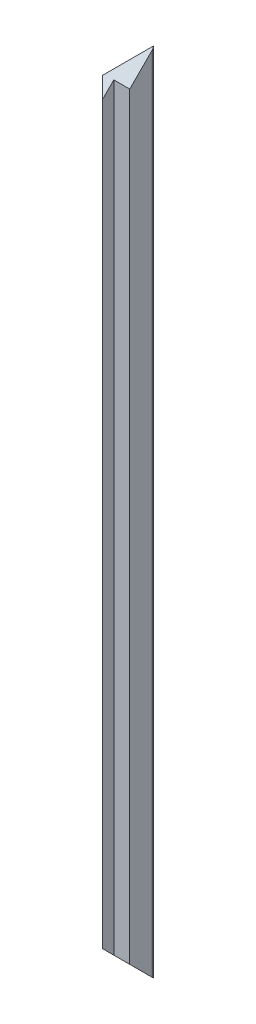
ISO-10303-21;
HEADER;
FILE_DESCRIPTION(('STEP AP214'),'2;1');
FILE_NAME('part.step','',(''),(''),'','','');
FILE_SCHEMA(('AUTOMOTIVE_DESIGN { 1 0 10303 214 1 1 1 1 }'));
ENDSEC;
DATA;
#1=APPLICATION_CONTEXT('core data for automotive mechanical design processes');
#2=APPLICATION_PROTOCOL_DEFINITION('international standard','automotive_design',2000,#1);
#3=PRODUCT_CONTEXT('',#1,'mechanical');
#4=PRODUCT('Part','Part','',(#3));
#5=PRODUCT_RELATED_PRODUCT_CATEGORY('part','',(#4));
#6=PRODUCT_DEFINITION_FORMATION('','',#4);
#7=PRODUCT_DEFINITION_CONTEXT('part definition',#1,'design');
#8=PRODUCT_DEFINITION('design','',#6,#7);
#9=PRODUCT_DEFINITION_SHAPE('','',#8);
#10=(LENGTH_UNIT() NAMED_UNIT(*) SI_UNIT(.MILLI.,.METRE.));
#11=(NAMED_UNIT(*) PLANE_ANGLE_UNIT() SI_UNIT($,.RADIAN.));
#12=(NAMED_UNIT(*) SI_UNIT($,.STERADIAN.) SOLID_ANGLE_UNIT());
#13=UNCERTAINTY_MEASURE_WITH_UNIT(LENGTH_MEASURE(1.E-05),#10,'distance_accuracy_value','');
#14=(GEOMETRIC_REPRESENTATION_CONTEXT(3) GLOBAL_UNCERTAINTY_ASSIGNED_CONTEXT((#13)) GLOBAL_UNIT_ASSIGNED_CONTEXT((#10,
#11,#12)) REPRESENTATION_CONTEXT('',''));
#15=CARTESIAN_POINT('',(0.,0.,0.));
#16=DIRECTION('',(0.,0.,1.));
#17=DIRECTION('',(1.,0.,0.));
#18=AXIS2_PLACEMENT_3D('',#15,#16,#17);
#19=CARTESIAN_POINT('',(118.75,127.,-118.75));
#20=DIRECTION('',(0.707106781186548,0.,-0.707106781186548));
#21=DIRECTION('',(-0.707106781186548,0.,-0.707106781186548));
#22=AXIS2_PLACEMENT_3D('',#19,#20,#21);
#23=PLANE('',#22);
#24=DIRECTION('',(0.577350269189626,-0.577350269189625,0.577350269189626));
#25=VECTOR('',#24,1.);
#26=CARTESIAN_POINT('',(116.,121.5,-121.5));
#27=LINE('',#26,#25);
#28=CARTESIAN_POINT('',(118.75,118.75,-118.75));
#29=VERTEX_POINT('',#28);
#30=CARTESIAN_POINT('',(122.,115.5,-115.5));
#31=VERTEX_POINT('',#30);
#32=EDGE_CURVE('E195',#29,#31,#27,.T.);
#33=ORIENTED_EDGE('',*,*,#32,.F.);
#34=DIRECTION('',(-0.577350269189626,-0.577350269189625,-0.577350269189626));
#35=VECTOR('',#34,1.);
#36=CARTESIAN_POINT('',(121.5,121.5,-116.));
#37=LINE('',#36,#35);
#38=CARTESIAN_POINT('',(115.5,115.5,-122.));
#39=VERTEX_POINT('',#38);
#40=EDGE_CURVE('E173',#29,#39,#37,.T.);
#41=ORIENTED_EDGE('',*,*,#40,.T.);
#42=DIRECTION('',(0.,-1.,0.));
#43=VECTOR('',#42,1.);
#44=CARTESIAN_POINT('',(115.5,127.,-122.));
#45=LINE('',#44,#43);
#46=CARTESIAN_POINT('',(115.5,-115.5,-122.));
#47=VERTEX_POINT('',#46);
#48=EDGE_CURVE('E137',#39,#47,#45,.T.);
#49=ORIENTED_EDGE('',*,*,#48,.T.);
#50=DIRECTION('',(-0.577350269189626,0.577350269189625,-0.577350269189626));
#51=VECTOR('',#50,1.);
#52=CARTESIAN_POINT('',(121.5,-121.5,-116.));
#53=LINE('',#52,#51);
#54=CARTESIAN_POINT('',(118.75,-118.75,-118.75));
#55=VERTEX_POINT('',#54);
#56=EDGE_CURVE('E122',#55,#47,#53,.T.);
#57=ORIENTED_EDGE('',*,*,#56,.F.);
#58=DIRECTION('',(0.577350269189626,0.577350269189625,0.577350269189626));
#59=VECTOR('',#58,1.);
#60=CARTESIAN_POINT('',(116.,-121.5,-121.5));
#61=LINE('',#60,#59);
#62=CARTESIAN_POINT('',(122.,-115.5,-115.5));
#63=VERTEX_POINT('',#62);
#64=EDGE_CURVE('E134',#55,#63,#61,.T.);
#65=ORIENTED_EDGE('',*,*,#64,.T.);
#66=DIRECTION('',(0.,-1.,0.));
#67=VECTOR('',#66,1.);
#68=CARTESIAN_POINT('',(122.,127.,-115.5));
#69=LINE('',#68,#67);
#70=EDGE_CURVE('E204',#31,#63,#69,.T.);
#71=ORIENTED_EDGE('',*,*,#70,.F.);
#72=EDGE_LOOP('',(#33,#41,#49,#57,#65,#71));
#73=FACE_BOUND('',#72,.T.);
#74=ADVANCED_FACE('F39',(#73),#23,.F.);
#75=CARTESIAN_POINT('',(122.,127.,-115.5));
#76=DIRECTION('',(-1.,0.,0.));
#77=DIRECTION('',(0.,0.,1.));
#78=AXIS2_PLACEMENT_3D('',#75,#76,#77);
#79=PLANE('',#78);
#80=DIRECTION('',(0.,0.707106781186547,-0.707106781186548));
#81=VECTOR('',#80,1.);
#82=CARTESIAN_POINT('',(122.,121.25,-121.25));
#83=LINE('',#82,#81);
#84=CARTESIAN_POINT('',(122.,119.,-119.));
#85=VERTEX_POINT('',#84);
#86=EDGE_CURVE('E192',#31,#85,#83,.T.);
#87=ORIENTED_EDGE('',*,*,#86,.F.);
#88=ORIENTED_EDGE('',*,*,#70,.T.);
#89=DIRECTION('',(0.,-0.707106781186547,-0.707106781186548));
#90=VECTOR('',#89,1.);
#91=CARTESIAN_POINT('',(122.,-121.25,-121.25));
#92=LINE('',#91,#90);
#93=CARTESIAN_POINT('',(122.,-119.,-119.));
#94=VERTEX_POINT('',#93);
#95=EDGE_CURVE('E146',#63,#94,#92,.T.);
#96=ORIENTED_EDGE('',*,*,#95,.T.);
#97=DIRECTION('',(0.,-1.,0.));
#98=VECTOR('',#97,1.);
#99=CARTESIAN_POINT('',(122.,127.,-119.));
#100=LINE('',#99,#98);
#101=EDGE_CURVE('E201',#85,#94,#100,.T.);
#102=ORIENTED_EDGE('',*,*,#101,.F.);
#103=EDGE_LOOP('',(#87,#88,#96,#102));
#104=FACE_BOUND('',#103,.T.);
#105=ADVANCED_FACE('F247',(#104),#79,.F.);
#106=CARTESIAN_POINT('',(127.,127.,-119.));
#107=DIRECTION('',(0.,0.,-1.));
#108=DIRECTION('',(-1.,0.,0.));
#109=AXIS2_PLACEMENT_3D('',#106,#107,#108);
#110=PLANE('',#109);
#111=DIRECTION('',(1.,0.,0.));
#112=VECTOR('',#111,1.);
#113=CARTESIAN_POINT('',(127.,119.,-119.));
#114=LINE('',#113,#112);
#115=CARTESIAN_POINT('',(127.,119.,-119.));
#116=VERTEX_POINT('',#115);
#117=EDGE_CURVE('E187',#85,#116,#114,.T.);
#118=ORIENTED_EDGE('',*,*,#117,.F.);
#119=ORIENTED_EDGE('',*,*,#101,.T.);
#120=DIRECTION('',(1.,0.,0.));
#121=VECTOR('',#120,1.);
#122=CARTESIAN_POINT('',(127.,-119.,-119.));
#123=LINE('',#122,#121);
#124=CARTESIAN_POINT('',(127.,-119.,-119.));
#125=VERTEX_POINT('',#124);
#126=EDGE_CURVE('E154',#94,#125,#123,.T.);
#127=ORIENTED_EDGE('',*,*,#126,.T.);
#128=DIRECTION('',(0.,-1.,0.));
#129=VECTOR('',#128,1.);
#130=CARTESIAN_POINT('',(127.,127.,-119.));
#131=LINE('',#130,#129);
#132=EDGE_CURVE('E198',#116,#125,#131,.T.);
#133=ORIENTED_EDGE('',*,*,#132,.F.);
#134=EDGE_LOOP('',(#118,#119,#127,#133));
#135=FACE_BOUND('',#134,.T.);
#136=ADVANCED_FACE('F249',(#135),#110,.F.);
#137=CARTESIAN_POINT('',(127.,127.,-127.));
#138=DIRECTION('',(-1.,0.,0.));
#139=DIRECTION('',(0.,0.,1.));
#140=AXIS2_PLACEMENT_3D('',#137,#138,#139);
#141=PLANE('',#140);
#142=DIRECTION('',(0.,-0.707106781186547,-0.707106781186548));
#143=VECTOR('',#142,1.);
#144=CARTESIAN_POINT('',(127.,-127.,-127.));
#145=LINE('',#144,#143);
#146=CARTESIAN_POINT('',(127.,-126.,-126.));
#147=VERTEX_POINT('',#146);
#148=EDGE_CURVE('E128',#125,#147,#145,.T.);
#149=ORIENTED_EDGE('',*,*,#148,.T.);
#150=DIRECTION('',(0.,-1.,0.));
#151=VECTOR('',#150,1.);
#152=CARTESIAN_POINT('',(127.,127.,-126.));
#153=LINE('',#152,#151);
#154=CARTESIAN_POINT('',(127.,126.,-126.));
#155=VERTEX_POINT('',#154);
#156=EDGE_CURVE('E62',#147,#155,#153,.F.);
#157=ORIENTED_EDGE('',*,*,#156,.T.);
#158=DIRECTION('',(0.,0.707106781186547,-0.707106781186548));
#159=VECTOR('',#158,1.);
#160=CARTESIAN_POINT('',(127.,127.,-127.));
#161=LINE('',#160,#159);
#162=EDGE_CURVE('E184',#116,#155,#161,.T.);
#163=ORIENTED_EDGE('',*,*,#162,.F.);
#164=ORIENTED_EDGE('',*,*,#132,.T.);
#165=EDGE_LOOP('',(#149,#157,#163,#164));
#166=FACE_BOUND('',#165,.T.);
#167=ADVANCED_FACE('F221',(#166),#141,.F.);
#168=CARTESIAN_POINT('',(78.0833333333333,78.0833333333333,-78.0833333333334));
#169=DIRECTION('',(0.,0.707106781186548,0.707106781186547));
#170=DIRECTION('',(0.,-0.707106781186547,0.707106781186548));
#171=AXIS2_PLACEMENT_3D('',#168,#169,#170);
#172=PLANE('',#171);
#173=ORIENTED_EDGE('',*,*,#162,.T.);
#174=CARTESIAN_POINT('',(126.,126.,-126.));
#175=DIRECTION('',(0.,0.707106781186548,0.707106781186547));
#176=DIRECTION('',(0.,-0.707106781186547,0.707106781186548));
#177=AXIS2_PLACEMENT_3D('',#174,#175,#176);
#178=ELLIPSE('',#177,1.41421356237309,1.);
#179=CARTESIAN_POINT('',(126.707106781186,126.707106781186,-126.707106781186));
#180=VERTEX_POINT('',#179);
#181=EDGE_CURVE('E48',#155,#180,#178,.T.);
#182=ORIENTED_EDGE('',*,*,#181,.T.);
#183=DIRECTION('',(0.577350269189626,0.577350269189626,-0.577350269189625));
#184=VECTOR('',#183,1.);
#185=CARTESIAN_POINT('',(78.0833333333333,78.0833333333333,-78.0833333333333));
#186=LINE('',#185,#184);
#187=EDGE_CURVE('E148',#29,#180,#186,.T.);
#188=ORIENTED_EDGE('',*,*,#187,.F.);
#189=ORIENTED_EDGE('',*,*,#32,.T.);
#190=ORIENTED_EDGE('',*,*,#86,.T.);
#191=ORIENTED_EDGE('',*,*,#117,.T.);
#192=EDGE_LOOP('',(#173,#182,#188,#189,#190,#191));
#193=FACE_BOUND('',#192,.T.);
#194=ADVANCED_FACE('F243',(#193),#172,.T.);
#195=CARTESIAN_POINT('',(115.5,127.,-122.));
#196=DIRECTION('',(0.,0.,1.));
#197=DIRECTION('',(-1.,0.,0.));
#198=AXIS2_PLACEMENT_3D('',#195,#196,#197);
#199=PLANE('',#198);
#200=DIRECTION('',(0.707106781186548,0.707106781186547,0.));
#201=VECTOR('',#200,1.);
#202=CARTESIAN_POINT('',(121.25,121.25,-122.));
#203=LINE('',#202,#201);
#204=CARTESIAN_POINT('',(119.,119.,-122.));
#205=VERTEX_POINT('',#204);
#206=EDGE_CURVE('E169',#39,#205,#203,.T.);
#207=ORIENTED_EDGE('',*,*,#206,.T.);
#208=DIRECTION('',(0.,-1.,0.));
#209=VECTOR('',#208,1.);
#210=CARTESIAN_POINT('',(119.,127.,-122.));
#211=LINE('',#210,#209);
#212=CARTESIAN_POINT('',(119.,-119.,-122.));
#213=VERTEX_POINT('',#212);
#214=EDGE_CURVE('E179',#205,#213,#211,.T.);
#215=ORIENTED_EDGE('',*,*,#214,.T.);
#216=DIRECTION('',(0.707106781186548,-0.707106781186547,0.));
#217=VECTOR('',#216,1.);
#218=CARTESIAN_POINT('',(121.25,-121.25,-122.));
#219=LINE('',#218,#217);
#220=EDGE_CURVE('E140',#47,#213,#219,.T.);
#221=ORIENTED_EDGE('',*,*,#220,.F.);
#222=ORIENTED_EDGE('',*,*,#48,.F.);
#223=EDGE_LOOP('',(#207,#215,#221,#222));
#224=FACE_BOUND('',#223,.T.);
#225=ADVANCED_FACE('F241',(#224),#199,.F.);
#226=CARTESIAN_POINT('',(119.,127.,-127.));
#227=DIRECTION('',(1.,0.,0.));
#228=DIRECTION('',(0.,0.,1.));
#229=AXIS2_PLACEMENT_3D('',#226,#227,#228);
#230=PLANE('',#229);
#231=DIRECTION('',(0.,0.,-1.));
#232=VECTOR('',#231,1.);
#233=CARTESIAN_POINT('',(119.,119.,-127.));
#234=LINE('',#233,#232);
#235=CARTESIAN_POINT('',(119.,119.,-127.));
#236=VERTEX_POINT('',#235);
#237=EDGE_CURVE('E163',#205,#236,#234,.T.);
#238=ORIENTED_EDGE('',*,*,#237,.T.);
#239=DIRECTION('',(0.,-1.,0.));
#240=VECTOR('',#239,1.);
#241=CARTESIAN_POINT('',(119.,127.,-127.));
#242=LINE('',#241,#240);
#243=CARTESIAN_POINT('',(119.,-119.,-127.));
#244=VERTEX_POINT('',#243);
#245=EDGE_CURVE('E176',#236,#244,#242,.T.);
#246=ORIENTED_EDGE('',*,*,#245,.T.);
#247=DIRECTION('',(0.,0.,-1.));
#248=VECTOR('',#247,1.);
#249=CARTESIAN_POINT('',(119.,-119.,-127.));
#250=LINE('',#249,#248);
#251=EDGE_CURVE('E258',#213,#244,#250,.T.);
#252=ORIENTED_EDGE('',*,*,#251,.F.);
#253=ORIENTED_EDGE('',*,*,#214,.F.);
#254=EDGE_LOOP('',(#238,#246,#252,#253));
#255=FACE_BOUND('',#254,.T.);
#256=ADVANCED_FACE('F239',(#255),#230,.F.);
#257=CARTESIAN_POINT('',(127.,127.,-127.));
#258=DIRECTION('',(0.,0.,1.));
#259=DIRECTION('',(-1.,0.,0.));
#260=AXIS2_PLACEMENT_3D('',#257,#258,#259);
#261=PLANE('',#260);
#262=DIRECTION('',(0.707106781186548,0.707106781186547,0.));
#263=VECTOR('',#262,1.);
#264=CARTESIAN_POINT('',(127.,127.,-127.));
#265=LINE('',#264,#263);
#266=CARTESIAN_POINT('',(126.,126.,-127.));
#267=VERTEX_POINT('',#266);
#268=EDGE_CURVE('E152',#236,#267,#265,.T.);
#269=ORIENTED_EDGE('',*,*,#268,.T.);
#270=DIRECTION('',(0.,-1.,0.));
#271=VECTOR('',#270,1.);
#272=CARTESIAN_POINT('',(126.,127.,-127.));
#273=LINE('',#272,#271);
#274=CARTESIAN_POINT('',(126.,-126.,-127.));
#275=VERTEX_POINT('',#274);
#276=EDGE_CURVE('E207',#267,#275,#273,.T.);
#277=ORIENTED_EDGE('',*,*,#276,.T.);
#278=DIRECTION('',(0.707106781186548,-0.707106781186547,0.));
#279=VECTOR('',#278,1.);
#280=CARTESIAN_POINT('',(127.,-127.,-127.));
#281=LINE('',#280,#279);
#282=EDGE_CURVE('E234',#244,#275,#281,.T.);
#283=ORIENTED_EDGE('',*,*,#282,.F.);
#284=ORIENTED_EDGE('',*,*,#245,.F.);
#285=EDGE_LOOP('',(#269,#277,#283,#284));
#286=FACE_BOUND('',#285,.T.);
#287=ADVANCED_FACE('F232',(#286),#261,.F.);
#288=CARTESIAN_POINT('',(78.0833333333334,78.0833333333333,-78.0833333333333));
#289=DIRECTION('',(-0.707106781186547,0.707106781186548,0.));
#290=DIRECTION('',(-0.707106781186548,-0.707106781186547,0.));
#291=AXIS2_PLACEMENT_3D('',#288,#289,#290);
#292=PLANE('',#291);
#293=ORIENTED_EDGE('',*,*,#187,.T.);
#294=CARTESIAN_POINT('',(126.,126.,-126.));
#295=DIRECTION('',(-0.707106781186547,0.707106781186548,0.));
#296=DIRECTION('',(-0.707106781186548,-0.707106781186547,0.));
#297=AXIS2_PLACEMENT_3D('',#294,#295,#296);
#298=ELLIPSE('',#297,1.41421356237309,1.);
#299=EDGE_CURVE('E11',#180,#267,#298,.T.);
#300=ORIENTED_EDGE('',*,*,#299,.T.);
#301=ORIENTED_EDGE('',*,*,#268,.F.);
#302=ORIENTED_EDGE('',*,*,#237,.F.);
#303=ORIENTED_EDGE('',*,*,#206,.F.);
#304=ORIENTED_EDGE('',*,*,#40,.F.);
#305=EDGE_LOOP('',(#293,#300,#301,#302,#303,#304));
#306=FACE_BOUND('',#305,.T.);
#307=ADVANCED_FACE('F228',(#306),#292,.T.);
#308=CARTESIAN_POINT('',(78.0833333333333,-78.0833333333333,-78.0833333333334));
#309=DIRECTION('',(0.,-0.707106781186548,0.707106781186547));
#310=DIRECTION('',(0.,0.707106781186547,0.707106781186548));
#311=AXIS2_PLACEMENT_3D('',#308,#309,#310);
#312=PLANE('',#311);
#313=DIRECTION('',(0.577350269189625,-0.577350269189626,-0.577350269189626));
#314=VECTOR('',#313,1.);
#315=CARTESIAN_POINT('',(78.0833333333333,-78.0833333333333,-78.0833333333333));
#316=LINE('',#315,#314);
#317=CARTESIAN_POINT('',(126.707106781186,-126.707106781186,-126.707106781187));
#318=VERTEX_POINT('',#317);
#319=EDGE_CURVE('E117',#55,#318,#316,.T.);
#320=ORIENTED_EDGE('',*,*,#319,.T.);
#321=CARTESIAN_POINT('',(126.,-126.,-126.));
#322=DIRECTION('',(0.,-0.707106781186548,0.707106781186547));
#323=DIRECTION('',(0.,-0.707106781186547,-0.707106781186548));
#324=AXIS2_PLACEMENT_3D('',#321,#322,#323);
#325=ELLIPSE('',#324,1.41421356237309,1.);
#326=EDGE_CURVE('E213',#318,#147,#325,.T.);
#327=ORIENTED_EDGE('',*,*,#326,.T.);
#328=ORIENTED_EDGE('',*,*,#148,.F.);
#329=ORIENTED_EDGE('',*,*,#126,.F.);
#330=ORIENTED_EDGE('',*,*,#95,.F.);
#331=ORIENTED_EDGE('',*,*,#64,.F.);
#332=EDGE_LOOP('',(#320,#327,#328,#329,#330,#331));
#333=FACE_BOUND('',#332,.T.);
#334=ADVANCED_FACE('F143',(#333),#312,.T.);
#335=CARTESIAN_POINT('',(78.0833333333334,-78.0833333333333,-78.0833333333333));
#336=DIRECTION('',(-0.707106781186547,-0.707106781186548,0.));
#337=DIRECTION('',(-0.707106781186548,0.707106781186547,0.));
#338=AXIS2_PLACEMENT_3D('',#335,#336,#337);
#339=PLANE('',#338);
#340=ORIENTED_EDGE('',*,*,#282,.T.);
#341=CARTESIAN_POINT('',(126.,-126.,-126.));
#342=DIRECTION('',(-0.707106781186547,-0.707106781186548,0.));
#343=DIRECTION('',(0.707106781186548,-0.707106781186547,0.));
#344=AXIS2_PLACEMENT_3D('',#341,#342,#343);
#345=ELLIPSE('',#344,1.41421356237309,1.);
#346=EDGE_CURVE('E123',#275,#318,#345,.T.);
#347=ORIENTED_EDGE('',*,*,#346,.T.);
#348=ORIENTED_EDGE('',*,*,#319,.F.);
#349=ORIENTED_EDGE('',*,*,#56,.T.);
#350=ORIENTED_EDGE('',*,*,#220,.T.);
#351=ORIENTED_EDGE('',*,*,#251,.T.);
#352=EDGE_LOOP('',(#340,#347,#348,#349,#350,#351));
#353=FACE_BOUND('',#352,.T.);
#354=ADVANCED_FACE('F120',(#353),#339,.T.);
#355=CARTESIAN_POINT('',(126.,127.,-126.));
#356=DIRECTION('',(0.,-1.,0.));
#357=DIRECTION('',(0.,0.,-1.));
#358=AXIS2_PLACEMENT_3D('',#355,#356,#357);
#359=CYLINDRICAL_SURFACE('',#358,1.);
#360=ORIENTED_EDGE('',*,*,#181,.F.);
#361=ORIENTED_EDGE('',*,*,#156,.F.);
#362=ORIENTED_EDGE('',*,*,#326,.F.);
#363=ORIENTED_EDGE('',*,*,#346,.F.);
#364=ORIENTED_EDGE('',*,*,#276,.F.);
#365=ORIENTED_EDGE('',*,*,#299,.F.);
#366=EDGE_LOOP('',(#360,#361,#362,#363,#364,#365));
#367=FACE_BOUND('',#366,.T.);
#368=ADVANCED_FACE('F41',(#367),#359,.T.);
#369=CLOSED_SHELL('',(#74,#105,#136,#167,#194,#225,#256,#287,#307,#334,#354,#368));
#370=MANIFOLD_SOLID_BREP('B2',#369);
#371=ADVANCED_BREP_SHAPE_REPRESENTATION('',(#18,#370),#14);
#372=SHAPE_DEFINITION_REPRESENTATION(#9,#371);
ENDSEC;
END-ISO-10303-21;
